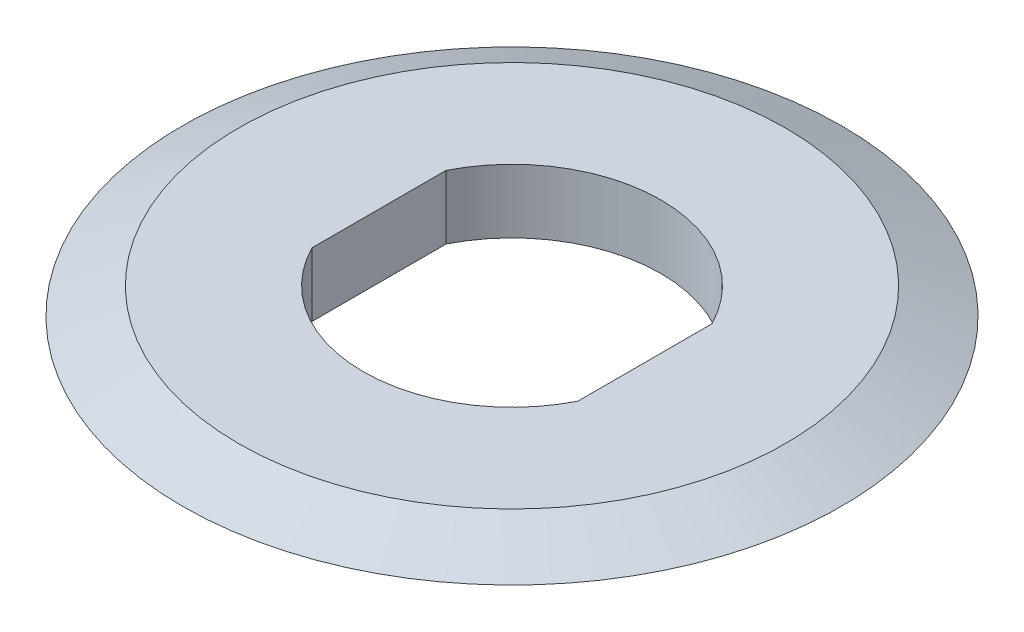
ISO-10303-21;
HEADER;
FILE_DESCRIPTION(('STEP AP214'),'2;1');
FILE_NAME('part.step','',(''),(''),'','','');
FILE_SCHEMA(('AUTOMOTIVE_DESIGN { 1 0 10303 214 1 1 1 1 }'));
ENDSEC;
DATA;
#1=APPLICATION_CONTEXT('core data for automotive mechanical design processes');
#2=APPLICATION_PROTOCOL_DEFINITION('international standard','automotive_design',2000,#1);
#3=PRODUCT_CONTEXT('',#1,'mechanical');
#4=PRODUCT('Part','Part','',(#3));
#5=PRODUCT_RELATED_PRODUCT_CATEGORY('part','',(#4));
#6=PRODUCT_DEFINITION_FORMATION('','',#4);
#7=PRODUCT_DEFINITION_CONTEXT('part definition',#1,'design');
#8=PRODUCT_DEFINITION('design','',#6,#7);
#9=PRODUCT_DEFINITION_SHAPE('','',#8);
#10=(LENGTH_UNIT() NAMED_UNIT(*) SI_UNIT(.MILLI.,.METRE.));
#11=(NAMED_UNIT(*) PLANE_ANGLE_UNIT() SI_UNIT($,.RADIAN.));
#12=(NAMED_UNIT(*) SI_UNIT($,.STERADIAN.) SOLID_ANGLE_UNIT());
#13=UNCERTAINTY_MEASURE_WITH_UNIT(LENGTH_MEASURE(1.E-05),#10,'distance_accuracy_value','');
#14=(GEOMETRIC_REPRESENTATION_CONTEXT(3) GLOBAL_UNCERTAINTY_ASSIGNED_CONTEXT((#13)) GLOBAL_UNIT_ASSIGNED_CONTEXT((#10,
#11,#12)) REPRESENTATION_CONTEXT('',''));
#15=CARTESIAN_POINT('',(0.,0.,0.));
#16=DIRECTION('',(0.,0.,1.));
#17=DIRECTION('',(1.,0.,0.));
#18=AXIS2_PLACEMENT_3D('',#15,#16,#17);
#19=CARTESIAN_POINT('',(0.,0.17194005771805,0.));
#20=DIRECTION('',(0.,1.,0.));
#21=DIRECTION('',(0.,0.,1.));
#22=AXIS2_PLACEMENT_3D('',#19,#20,#21);
#23=CONICAL_SURFACE('',#22,9.92,1.13446401379631);
#24=CARTESIAN_POINT('',(0.,-0.491538935183248,0.));
#25=DIRECTION('',(0.,-1.,0.));
#26=DIRECTION('',(0.,0.,-1.));
#27=AXIS2_PLACEMENT_3D('',#24,#25,#26);
#28=CIRCLE('',#27,8.49716470811046);
#29=CARTESIAN_POINT('',(0.,-0.491538935183248,-8.49716470811046));
#30=VERTEX_POINT('',#29);
#31=EDGE_CURVE('E11',#30,#30,#28,.F.);
#32=ORIENTED_EDGE('',*,*,#31,.T.);
#33=EDGE_LOOP('',(#32));
#34=FACE_BOUND('',#33,.T.);
#35=CARTESIAN_POINT('',(0.,0.17194005771805,0.));
#36=DIRECTION('',(0.,-1.,0.));
#37=DIRECTION('',(0.,0.,-1.));
#38=AXIS2_PLACEMENT_3D('',#35,#36,#37);
#39=CIRCLE('',#38,9.92);
#40=CARTESIAN_POINT('',(0.,0.17194005771805,-9.92));
#41=VERTEX_POINT('',#40);
#42=EDGE_CURVE('E129',#41,#41,#39,.T.);
#43=ORIENTED_EDGE('',*,*,#42,.T.);
#44=EDGE_LOOP('',(#43));
#45=FACE_BOUND('',#44,.T.);
#46=ADVANCED_FACE('F42',(#34,#45),#23,.T.);
#47=CARTESIAN_POINT('',(0.,-0.96,0.));
#48=DIRECTION('',(0.,1.,0.));
#49=DIRECTION('',(0.,0.,1.));
#50=AXIS2_PLACEMENT_3D('',#47,#48,#49);
#51=PLANE('',#50);
#52=CARTESIAN_POINT('',(0.,-0.96,0.));
#53=DIRECTION('',(0.,1.,0.));
#54=DIRECTION('',(0.,0.,1.));
#55=AXIS2_PLACEMENT_3D('',#52,#53,#54);
#56=CIRCLE('',#55,6.38407339940695);
#57=CARTESIAN_POINT('',(0.,-0.96,6.38407339940695));
#58=VERTEX_POINT('',#57);
#59=EDGE_CURVE('E51',#58,#58,#56,.F.);
#60=ORIENTED_EDGE('',*,*,#59,.T.);
#61=EDGE_LOOP('',(#60));
#62=FACE_BOUND('',#61,.T.);
#63=DIRECTION('',(0.,0.,-1.));
#64=VECTOR('',#63,1.);
#65=CARTESIAN_POINT('',(4.,-0.96,0.));
#66=LINE('',#65,#64);
#67=CARTESIAN_POINT('',(4.,-0.96,2.01752323406696));
#68=VERTEX_POINT('',#67);
#69=CARTESIAN_POINT('',(4.,-0.96,-2.01752323406696));
#70=VERTEX_POINT('',#69);
#71=EDGE_CURVE('E95',#68,#70,#66,.T.);
#72=ORIENTED_EDGE('',*,*,#71,.T.);
#73=CARTESIAN_POINT('',(0.,-0.96,0.));
#74=DIRECTION('',(0.,1.,0.));
#75=DIRECTION('',(0.,0.,1.));
#76=AXIS2_PLACEMENT_3D('',#73,#74,#75);
#77=CIRCLE('',#76,4.48);
#78=CARTESIAN_POINT('',(-4.,-0.96,-2.01752323406696));
#79=VERTEX_POINT('',#78);
#80=EDGE_CURVE('E101',#70,#79,#77,.T.);
#81=ORIENTED_EDGE('',*,*,#80,.T.);
#82=DIRECTION('',(0.,0.,1.));
#83=VECTOR('',#82,1.);
#84=CARTESIAN_POINT('',(-4.,-0.96,0.));
#85=LINE('',#84,#83);
#86=CARTESIAN_POINT('',(-4.,-0.96,2.01752323406696));
#87=VERTEX_POINT('',#86);
#88=EDGE_CURVE('E106',#79,#87,#85,.T.);
#89=ORIENTED_EDGE('',*,*,#88,.T.);
#90=CARTESIAN_POINT('',(0.,-0.96,0.));
#91=DIRECTION('',(0.,1.,0.));
#92=DIRECTION('',(0.,0.,1.));
#93=AXIS2_PLACEMENT_3D('',#90,#91,#92);
#94=CIRCLE('',#93,4.48);
#95=EDGE_CURVE('E58',#87,#68,#94,.T.);
#96=ORIENTED_EDGE('',*,*,#95,.T.);
#97=EDGE_LOOP('',(#72,#81,#89,#96));
#98=FACE_BOUND('',#97,.T.);
#99=ADVANCED_FACE('F104',(#62,#98),#51,.F.);
#100=CARTESIAN_POINT('',(0.,0.17194005771805,0.));
#101=DIRECTION('',(0.,-1.,0.));
#102=DIRECTION('',(0.,0.,-1.));
#103=AXIS2_PLACEMENT_3D('',#100,#101,#102);
#104=CONICAL_SURFACE('',#103,9.92,1.13446401379631);
#105=CARTESIAN_POINT('',(0.,0.96,0.));
#106=DIRECTION('',(0.,-1.,0.));
#107=DIRECTION('',(0.,0.,-1.));
#108=AXIS2_PLACEMENT_3D('',#105,#106,#107);
#109=CIRCLE('',#108,8.23);
#110=CARTESIAN_POINT('',(0.,0.96,-8.23));
#111=VERTEX_POINT('',#110);
#112=EDGE_CURVE('E134',#111,#111,#109,.T.);
#113=ORIENTED_EDGE('',*,*,#112,.T.);
#114=EDGE_LOOP('',(#113));
#115=FACE_BOUND('',#114,.T.);
#116=ORIENTED_EDGE('',*,*,#42,.F.);
#117=EDGE_LOOP('',(#116));
#118=FACE_BOUND('',#117,.T.);
#119=ADVANCED_FACE('F161',(#115,#118),#104,.T.);
#120=CARTESIAN_POINT('',(0.,0.96,0.));
#121=DIRECTION('',(0.,1.,0.));
#122=DIRECTION('',(0.,0.,1.));
#123=AXIS2_PLACEMENT_3D('',#120,#121,#122);
#124=PLANE('',#123);
#125=CARTESIAN_POINT('',(0.,0.96,0.));
#126=DIRECTION('',(0.,1.,0.));
#127=DIRECTION('',(0.,0.,1.));
#128=AXIS2_PLACEMENT_3D('',#125,#126,#127);
#129=CIRCLE('',#128,4.48);
#130=CARTESIAN_POINT('',(4.,0.96,-2.01752323406696));
#131=VERTEX_POINT('',#130);
#132=CARTESIAN_POINT('',(-4.,0.96,-2.01752323406696));
#133=VERTEX_POINT('',#132);
#134=EDGE_CURVE('E66',#131,#133,#129,.T.);
#135=ORIENTED_EDGE('',*,*,#134,.F.);
#136=DIRECTION('',(0.,0.,-1.));
#137=VECTOR('',#136,1.);
#138=CARTESIAN_POINT('',(4.,0.96,0.));
#139=LINE('',#138,#137);
#140=CARTESIAN_POINT('',(4.,0.96,2.01752323406696));
#141=VERTEX_POINT('',#140);
#142=EDGE_CURVE('E121',#141,#131,#139,.T.);
#143=ORIENTED_EDGE('',*,*,#142,.F.);
#144=CARTESIAN_POINT('',(0.,0.96,0.));
#145=DIRECTION('',(0.,1.,0.));
#146=DIRECTION('',(0.,0.,1.));
#147=AXIS2_PLACEMENT_3D('',#144,#145,#146);
#148=CIRCLE('',#147,4.48);
#149=CARTESIAN_POINT('',(-4.,0.96,2.01752323406696));
#150=VERTEX_POINT('',#149);
#151=EDGE_CURVE('E86',#150,#141,#148,.T.);
#152=ORIENTED_EDGE('',*,*,#151,.F.);
#153=DIRECTION('',(0.,0.,1.));
#154=VECTOR('',#153,1.);
#155=CARTESIAN_POINT('',(-4.,0.96,0.));
#156=LINE('',#155,#154);
#157=EDGE_CURVE('E115',#133,#150,#156,.T.);
#158=ORIENTED_EDGE('',*,*,#157,.F.);
#159=EDGE_LOOP('',(#135,#143,#152,#158));
#160=FACE_BOUND('',#159,.T.);
#161=ORIENTED_EDGE('',*,*,#112,.F.);
#162=EDGE_LOOP('',(#161));
#163=FACE_BOUND('',#162,.T.);
#164=ADVANCED_FACE('F165',(#160,#163),#124,.T.);
#165=CARTESIAN_POINT('',(0.,-0.96,0.));
#166=DIRECTION('',(0.,1.,0.));
#167=DIRECTION('',(0.,0.,1.));
#168=AXIS2_PLACEMENT_3D('',#165,#166,#167);
#169=CYLINDRICAL_SURFACE('',#168,4.48);
#170=ORIENTED_EDGE('',*,*,#134,.T.);
#171=DIRECTION('',(0.,1.,0.));
#172=VECTOR('',#171,1.);
#173=CARTESIAN_POINT('',(-4.,-0.96,-2.01752323406696));
#174=LINE('',#173,#172);
#175=EDGE_CURVE('E126',#79,#133,#174,.T.);
#176=ORIENTED_EDGE('',*,*,#175,.F.);
#177=ORIENTED_EDGE('',*,*,#80,.F.);
#178=DIRECTION('',(0.,1.,0.));
#179=VECTOR('',#178,1.);
#180=CARTESIAN_POINT('',(4.,-0.96,-2.01752323406696));
#181=LINE('',#180,#179);
#182=EDGE_CURVE('E91',#70,#131,#181,.T.);
#183=ORIENTED_EDGE('',*,*,#182,.T.);
#184=EDGE_LOOP('',(#170,#176,#177,#183));
#185=FACE_BOUND('',#184,.T.);
#186=ADVANCED_FACE('F167',(#185),#169,.F.);
#187=CARTESIAN_POINT('',(4.,-0.96,0.));
#188=DIRECTION('',(1.,0.,0.));
#189=DIRECTION('',(0.,0.,-1.));
#190=AXIS2_PLACEMENT_3D('',#187,#188,#189);
#191=PLANE('',#190);
#192=ORIENTED_EDGE('',*,*,#142,.T.);
#193=ORIENTED_EDGE('',*,*,#182,.F.);
#194=ORIENTED_EDGE('',*,*,#71,.F.);
#195=DIRECTION('',(0.,1.,0.));
#196=VECTOR('',#195,1.);
#197=CARTESIAN_POINT('',(4.,-0.96,2.01752323406696));
#198=LINE('',#197,#196);
#199=EDGE_CURVE('E82',#68,#141,#198,.T.);
#200=ORIENTED_EDGE('',*,*,#199,.T.);
#201=EDGE_LOOP('',(#192,#193,#194,#200));
#202=FACE_BOUND('',#201,.T.);
#203=ADVANCED_FACE('F96',(#202),#191,.F.);
#204=CARTESIAN_POINT('',(0.,-0.96,0.));
#205=DIRECTION('',(0.,1.,0.));
#206=DIRECTION('',(0.,0.,1.));
#207=AXIS2_PLACEMENT_3D('',#204,#205,#206);
#208=CYLINDRICAL_SURFACE('',#207,4.48);
#209=ORIENTED_EDGE('',*,*,#151,.T.);
#210=ORIENTED_EDGE('',*,*,#199,.F.);
#211=ORIENTED_EDGE('',*,*,#95,.F.);
#212=DIRECTION('',(0.,1.,0.));
#213=VECTOR('',#212,1.);
#214=CARTESIAN_POINT('',(-4.,-0.96,2.01752323406696));
#215=LINE('',#214,#213);
#216=EDGE_CURVE('E92',#87,#150,#215,.T.);
#217=ORIENTED_EDGE('',*,*,#216,.T.);
#218=EDGE_LOOP('',(#209,#210,#211,#217));
#219=FACE_BOUND('',#218,.T.);
#220=ADVANCED_FACE('F84',(#219),#208,.F.);
#221=CARTESIAN_POINT('',(-4.,-0.96,0.));
#222=DIRECTION('',(-1.,0.,0.));
#223=DIRECTION('',(0.,0.,1.));
#224=AXIS2_PLACEMENT_3D('',#221,#222,#223);
#225=PLANE('',#224);
#226=ORIENTED_EDGE('',*,*,#157,.T.);
#227=ORIENTED_EDGE('',*,*,#216,.F.);
#228=ORIENTED_EDGE('',*,*,#88,.F.);
#229=ORIENTED_EDGE('',*,*,#175,.T.);
#230=EDGE_LOOP('',(#226,#227,#228,#229));
#231=FACE_BOUND('',#230,.T.);
#232=ADVANCED_FACE('F147',(#231),#225,.F.);
#233=CARTESIAN_POINT('',(0.,4.04,0.));
#234=DIRECTION('',(0.,1.,0.));
#235=DIRECTION('',(0.,0.,1.));
#236=AXIS2_PLACEMENT_3D('',#233,#234,#235);
#237=TOROIDAL_SURFACE('',#236,6.38407339940695,5.);
#238=ORIENTED_EDGE('',*,*,#31,.F.);
#239=EDGE_LOOP('',(#238));
#240=FACE_BOUND('',#239,.T.);
#241=ORIENTED_EDGE('',*,*,#59,.F.);
#242=EDGE_LOOP('',(#241));
#243=FACE_BOUND('',#242,.T.);
#244=ADVANCED_FACE('F44',(#240,#243),#237,.T.);
#245=CLOSED_SHELL('',(#46,#99,#119,#164,#186,#203,#220,#232,#244));
#246=MANIFOLD_SOLID_BREP('B2',#245);
#247=ADVANCED_BREP_SHAPE_REPRESENTATION('',(#18,#246),#14);
#248=SHAPE_DEFINITION_REPRESENTATION(#9,#247);
ENDSEC;
END-ISO-10303-21;
